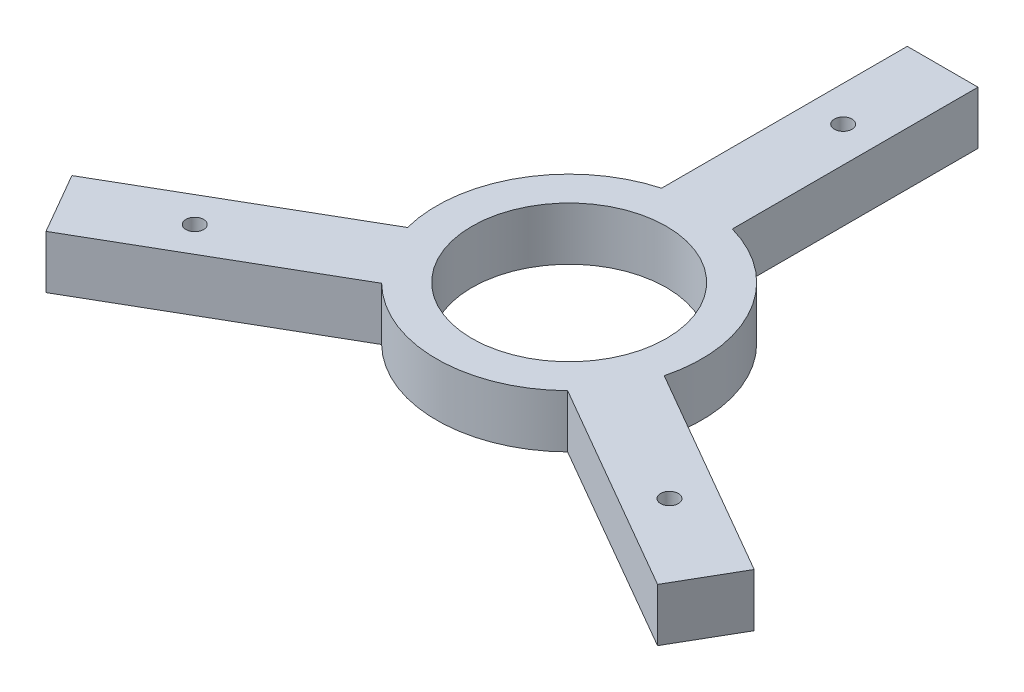
ISO-10303-21;
HEADER;
FILE_DESCRIPTION(('STEP AP214'),'2;1');
FILE_NAME('part.step','',(''),(''),'','','');
FILE_SCHEMA(('AUTOMOTIVE_DESIGN { 1 0 10303 214 1 1 1 1 }'));
ENDSEC;
DATA;
#1=APPLICATION_CONTEXT('core data for automotive mechanical design processes');
#2=APPLICATION_PROTOCOL_DEFINITION('international standard','automotive_design',2000,#1);
#3=PRODUCT_CONTEXT('',#1,'mechanical');
#4=PRODUCT('Part','Part','',(#3));
#5=PRODUCT_RELATED_PRODUCT_CATEGORY('part','',(#4));
#6=PRODUCT_DEFINITION_FORMATION('','',#4);
#7=PRODUCT_DEFINITION_CONTEXT('part definition',#1,'design');
#8=PRODUCT_DEFINITION('design','',#6,#7);
#9=PRODUCT_DEFINITION_SHAPE('','',#8);
#10=(LENGTH_UNIT() NAMED_UNIT(*) SI_UNIT(.MILLI.,.METRE.));
#11=(NAMED_UNIT(*) PLANE_ANGLE_UNIT() SI_UNIT($,.RADIAN.));
#12=(NAMED_UNIT(*) SI_UNIT($,.STERADIAN.) SOLID_ANGLE_UNIT());
#13=UNCERTAINTY_MEASURE_WITH_UNIT(LENGTH_MEASURE(1.E-05),#10,'distance_accuracy_value','');
#14=(GEOMETRIC_REPRESENTATION_CONTEXT(3) GLOBAL_UNCERTAINTY_ASSIGNED_CONTEXT((#13)) GLOBAL_UNIT_ASSIGNED_CONTEXT((#10,
#11,#12)) REPRESENTATION_CONTEXT('',''));
#15=CARTESIAN_POINT('',(0.,0.,0.));
#16=DIRECTION('',(0.,0.,1.));
#17=DIRECTION('',(1.,0.,0.));
#18=AXIS2_PLACEMENT_3D('',#15,#16,#17);
#19=CARTESIAN_POINT('',(0.,3.,0.));
#20=DIRECTION('',(0.,1.,0.));
#21=DIRECTION('',(0.,0.,1.));
#22=AXIS2_PLACEMENT_3D('',#19,#20,#21);
#23=PLANE('',#22);
#24=CARTESIAN_POINT('',(13.4233937586588,3.,7.75000000000006));
#25=DIRECTION('',(0.,1.,0.));
#26=DIRECTION('',(0.,0.,1.));
#27=AXIS2_PLACEMENT_3D('',#24,#25,#26);
#28=CIRCLE('',#27,0.499999999999999);
#29=CARTESIAN_POINT('',(13.4233937586588,3.,8.25000000000006));
#30=VERTEX_POINT('',#29);
#31=EDGE_CURVE('E446',#30,#30,#28,.T.);
#32=ORIENTED_EDGE('',*,*,#31,.F.);
#33=EDGE_LOOP('',(#32));
#34=FACE_BOUND('',#33,.T.);
#35=CARTESIAN_POINT('',(0.,3.,0.));
#36=DIRECTION('',(0.,1.,0.));
#37=DIRECTION('',(0.,0.,1.));
#38=AXIS2_PLACEMENT_3D('',#35,#36,#37);
#39=CIRCLE('',#38,5.5);
#40=CARTESIAN_POINT('',(0.,3.,5.5));
#41=VERTEX_POINT('',#40);
#42=EDGE_CURVE('E313',#41,#41,#39,.T.);
#43=ORIENTED_EDGE('',*,*,#42,.F.);
#44=EDGE_LOOP('',(#43));
#45=FACE_BOUND('',#44,.T.);
#46=CARTESIAN_POINT('',(0.,3.,0.));
#47=DIRECTION('',(0.,1.,0.));
#48=DIRECTION('',(0.,0.,1.));
#49=AXIS2_PLACEMENT_3D('',#46,#47,#48);
#50=CIRCLE('',#49,7.5);
#51=CARTESIAN_POINT('',(-2.,3.,-7.22841614740048));
#52=VERTEX_POINT('',#51);
#53=CARTESIAN_POINT('',(-7.25999201277445,3.,1.8821572661314));
#54=VERTEX_POINT('',#53);
#55=EDGE_CURVE('E332',#52,#54,#50,.T.);
#56=ORIENTED_EDGE('',*,*,#55,.T.);
#57=DIRECTION('',(-0.866025403784436,0.,0.500000000000004));
#58=VECTOR('',#57,1.);
#59=CARTESIAN_POINT('',(-7.25999201277445,3.,1.8821572661314));
#60=LINE('',#59,#58);
#61=CARTESIAN_POINT('',(-19.2934662978758,3.,8.82968688392118));
#62=VERTEX_POINT('',#61);
#63=EDGE_CURVE('E260',#54,#62,#60,.T.);
#64=ORIENTED_EDGE('',*,*,#63,.T.);
#65=DIRECTION('',(0.500000000000005,0.,0.866025403784436));
#66=VECTOR('',#65,1.);
#67=CARTESIAN_POINT('',(-19.2934662978758,3.,8.82968688392118));
#68=LINE('',#67,#66);
#69=CARTESIAN_POINT('',(-17.2934662978758,3.,12.2937884990589));
#70=VERTEX_POINT('',#69);
#71=EDGE_CURVE('E359',#62,#70,#68,.T.);
#72=ORIENTED_EDGE('',*,*,#71,.T.);
#73=DIRECTION('',(0.866025403784436,0.,-0.500000000000004));
#74=VECTOR('',#73,1.);
#75=CARTESIAN_POINT('',(-17.2934662978758,3.,12.2937884990589));
#76=LINE('',#75,#74);
#77=CARTESIAN_POINT('',(-5.25999201277443,3.,5.34625888126914));
#78=VERTEX_POINT('',#77);
#79=EDGE_CURVE('E378',#70,#78,#76,.T.);
#80=ORIENTED_EDGE('',*,*,#79,.T.);
#81=CARTESIAN_POINT('',(0.,3.,0.));
#82=DIRECTION('',(0.,1.,0.));
#83=DIRECTION('',(0.,0.,1.));
#84=AXIS2_PLACEMENT_3D('',#81,#82,#83);
#85=CIRCLE('',#84,7.5);
#86=CARTESIAN_POINT('',(5.25999201277443,3.,5.34625888126914));
#87=VERTEX_POINT('',#86);
#88=EDGE_CURVE('E375',#78,#87,#85,.T.);
#89=ORIENTED_EDGE('',*,*,#88,.T.);
#90=DIRECTION('',(0.866025403784436,0.,0.500000000000004));
#91=VECTOR('',#90,1.);
#92=CARTESIAN_POINT('',(5.25999201277443,3.,5.34625888126914));
#93=LINE('',#92,#91);
#94=CARTESIAN_POINT('',(17.2934662978757,3.,12.2937884990589));
#95=VERTEX_POINT('',#94);
#96=EDGE_CURVE('E377',#87,#95,#93,.T.);
#97=ORIENTED_EDGE('',*,*,#96,.T.);
#98=DIRECTION('',(0.500000000000004,0.,-0.866025403784437));
#99=VECTOR('',#98,1.);
#100=CARTESIAN_POINT('',(17.2934662978757,3.,12.2937884990589));
#101=LINE('',#100,#99);
#102=CARTESIAN_POINT('',(19.2934662978757,3.,8.8296868839211));
#103=VERTEX_POINT('',#102);
#104=EDGE_CURVE('E380',#95,#103,#101,.T.);
#105=ORIENTED_EDGE('',*,*,#104,.T.);
#106=DIRECTION('',(-0.866025403784437,0.,-0.500000000000004));
#107=VECTOR('',#106,1.);
#108=CARTESIAN_POINT('',(19.2934662978757,3.,8.8296868839211));
#109=LINE('',#108,#107);
#110=CARTESIAN_POINT('',(7.25999201277445,3.,1.88215726613139));
#111=VERTEX_POINT('',#110);
#112=EDGE_CURVE('E386',#103,#111,#109,.T.);
#113=ORIENTED_EDGE('',*,*,#112,.T.);
#114=CARTESIAN_POINT('',(0.,3.,0.));
#115=DIRECTION('',(0.,1.,0.));
#116=DIRECTION('',(0.,0.,1.));
#117=AXIS2_PLACEMENT_3D('',#114,#115,#116);
#118=CIRCLE('',#117,7.5);
#119=CARTESIAN_POINT('',(2.,3.,-7.22841614740048));
#120=VERTEX_POINT('',#119);
#121=EDGE_CURVE('E291',#111,#120,#118,.T.);
#122=ORIENTED_EDGE('',*,*,#121,.T.);
#123=DIRECTION('',(0.,0.,-1.));
#124=VECTOR('',#123,1.);
#125=CARTESIAN_POINT('',(2.,3.,-7.22841614740048));
#126=LINE('',#125,#124);
#127=CARTESIAN_POINT('',(1.99999999999999,3.,-21.1234753829798));
#128=VERTEX_POINT('',#127);
#129=EDGE_CURVE('E285',#120,#128,#126,.T.);
#130=ORIENTED_EDGE('',*,*,#129,.T.);
#131=DIRECTION('',(-1.,0.,0.));
#132=VECTOR('',#131,1.);
#133=CARTESIAN_POINT('',(1.99999999999999,3.,-21.1234753829798));
#134=LINE('',#133,#132);
#135=CARTESIAN_POINT('',(-2.00000000000001,3.,-21.1234753829798));
#136=VERTEX_POINT('',#135);
#137=EDGE_CURVE('E289',#128,#136,#134,.T.);
#138=ORIENTED_EDGE('',*,*,#137,.T.);
#139=DIRECTION('',(0.,0.,1.));
#140=VECTOR('',#139,1.);
#141=CARTESIAN_POINT('',(-2.00000000000001,3.,-21.1234753829798));
#142=LINE('',#141,#140);
#143=EDGE_CURVE('E205',#136,#52,#142,.T.);
#144=ORIENTED_EDGE('',*,*,#143,.T.);
#145=EDGE_LOOP('',(#56,#64,#72,#80,#89,#97,#105,#113,#122,#130,#138,#144));
#146=FACE_BOUND('',#145,.T.);
#147=CARTESIAN_POINT('',(-13.4233937586588,3.,7.75000000000006));
#148=DIRECTION('',(0.,1.,0.));
#149=DIRECTION('',(0.,0.,1.));
#150=AXIS2_PLACEMENT_3D('',#147,#148,#149);
#151=CIRCLE('',#150,0.499999999999999);
#152=CARTESIAN_POINT('',(-13.4233937586588,3.,8.25000000000006));
#153=VERTEX_POINT('',#152);
#154=EDGE_CURVE('E452',#153,#153,#151,.T.);
#155=ORIENTED_EDGE('',*,*,#154,.F.);
#156=EDGE_LOOP('',(#155));
#157=FACE_BOUND('',#156,.T.);
#158=CARTESIAN_POINT('',(0.,3.,-15.5));
#159=DIRECTION('',(0.,1.,0.));
#160=DIRECTION('',(0.,0.,1.));
#161=AXIS2_PLACEMENT_3D('',#158,#159,#160);
#162=CIRCLE('',#161,0.500000000000001);
#163=CARTESIAN_POINT('',(0.,3.,-15.));
#164=VERTEX_POINT('',#163);
#165=EDGE_CURVE('E437',#164,#164,#162,.T.);
#166=ORIENTED_EDGE('',*,*,#165,.F.);
#167=EDGE_LOOP('',(#166));
#168=FACE_BOUND('',#167,.T.);
#169=ADVANCED_FACE('F188',(#34,#45,#146,#157,#168),#23,.T.);
#170=CARTESIAN_POINT('',(0.,0.,0.));
#171=DIRECTION('',(0.,1.,0.));
#172=DIRECTION('',(0.,0.,1.));
#173=AXIS2_PLACEMENT_3D('',#170,#171,#172);
#174=PLANE('',#173);
#175=CARTESIAN_POINT('',(0.,0.,0.));
#176=DIRECTION('',(0.,1.,0.));
#177=DIRECTION('',(0.,0.,1.));
#178=AXIS2_PLACEMENT_3D('',#175,#176,#177);
#179=CIRCLE('',#178,7.5);
#180=CARTESIAN_POINT('',(-2.,0.,-7.22841614740048));
#181=VERTEX_POINT('',#180);
#182=CARTESIAN_POINT('',(-7.25999201277445,0.,1.8821572661314));
#183=VERTEX_POINT('',#182);
#184=EDGE_CURVE('E309',#181,#183,#179,.T.);
#185=ORIENTED_EDGE('',*,*,#184,.F.);
#186=DIRECTION('',(0.,0.,1.));
#187=VECTOR('',#186,1.);
#188=CARTESIAN_POINT('',(-2.00000000000001,0.,-21.1234753829798));
#189=LINE('',#188,#187);
#190=CARTESIAN_POINT('',(-2.00000000000001,0.,-21.1234753829798));
#191=VERTEX_POINT('',#190);
#192=EDGE_CURVE('E252',#191,#181,#189,.T.);
#193=ORIENTED_EDGE('',*,*,#192,.F.);
#194=DIRECTION('',(-1.,0.,0.));
#195=VECTOR('',#194,1.);
#196=CARTESIAN_POINT('',(1.99999999999999,0.,-21.1234753829798));
#197=LINE('',#196,#195);
#198=CARTESIAN_POINT('',(1.99999999999999,0.,-21.1234753829798));
#199=VERTEX_POINT('',#198);
#200=EDGE_CURVE('E246',#199,#191,#197,.T.);
#201=ORIENTED_EDGE('',*,*,#200,.F.);
#202=DIRECTION('',(0.,0.,-1.));
#203=VECTOR('',#202,1.);
#204=CARTESIAN_POINT('',(2.,0.,-7.22841614740048));
#205=LINE('',#204,#203);
#206=CARTESIAN_POINT('',(2.,0.,-7.22841614740048));
#207=VERTEX_POINT('',#206);
#208=EDGE_CURVE('E299',#207,#199,#205,.T.);
#209=ORIENTED_EDGE('',*,*,#208,.F.);
#210=CARTESIAN_POINT('',(0.,0.,0.));
#211=DIRECTION('',(0.,1.,0.));
#212=DIRECTION('',(0.,0.,1.));
#213=AXIS2_PLACEMENT_3D('',#210,#211,#212);
#214=CIRCLE('',#213,7.5);
#215=CARTESIAN_POINT('',(7.25999201277445,0.,1.88215726613139));
#216=VERTEX_POINT('',#215);
#217=EDGE_CURVE('E327',#216,#207,#214,.T.);
#218=ORIENTED_EDGE('',*,*,#217,.F.);
#219=DIRECTION('',(-0.866025403784437,0.,-0.500000000000004));
#220=VECTOR('',#219,1.);
#221=CARTESIAN_POINT('',(19.2934662978757,0.,8.8296868839211));
#222=LINE('',#221,#220);
#223=CARTESIAN_POINT('',(19.2934662978757,0.,8.8296868839211));
#224=VERTEX_POINT('',#223);
#225=EDGE_CURVE('E325',#224,#216,#222,.T.);
#226=ORIENTED_EDGE('',*,*,#225,.F.);
#227=DIRECTION('',(0.500000000000004,0.,-0.866025403784437));
#228=VECTOR('',#227,1.);
#229=CARTESIAN_POINT('',(17.2934662978757,0.,12.2937884990589));
#230=LINE('',#229,#228);
#231=CARTESIAN_POINT('',(17.2934662978757,0.,12.2937884990589));
#232=VERTEX_POINT('',#231);
#233=EDGE_CURVE('E323',#232,#224,#230,.T.);
#234=ORIENTED_EDGE('',*,*,#233,.F.);
#235=DIRECTION('',(0.866025403784436,0.,0.500000000000004));
#236=VECTOR('',#235,1.);
#237=CARTESIAN_POINT('',(5.25999201277443,0.,5.34625888126914));
#238=LINE('',#237,#236);
#239=CARTESIAN_POINT('',(5.25999201277443,0.,5.34625888126914));
#240=VERTEX_POINT('',#239);
#241=EDGE_CURVE('E321',#240,#232,#238,.T.);
#242=ORIENTED_EDGE('',*,*,#241,.F.);
#243=CARTESIAN_POINT('',(0.,0.,0.));
#244=DIRECTION('',(0.,1.,0.));
#245=DIRECTION('',(0.,0.,1.));
#246=AXIS2_PLACEMENT_3D('',#243,#244,#245);
#247=CIRCLE('',#246,7.5);
#248=CARTESIAN_POINT('',(-5.25999201277443,0.,5.34625888126914));
#249=VERTEX_POINT('',#248);
#250=EDGE_CURVE('E319',#249,#240,#247,.T.);
#251=ORIENTED_EDGE('',*,*,#250,.F.);
#252=DIRECTION('',(0.866025403784436,0.,-0.500000000000004));
#253=VECTOR('',#252,1.);
#254=CARTESIAN_POINT('',(-17.2934662978758,0.,12.2937884990589));
#255=LINE('',#254,#253);
#256=CARTESIAN_POINT('',(-17.2934662978758,0.,12.2937884990589));
#257=VERTEX_POINT('',#256);
#258=EDGE_CURVE('E317',#257,#249,#255,.T.);
#259=ORIENTED_EDGE('',*,*,#258,.F.);
#260=DIRECTION('',(0.500000000000005,0.,0.866025403784436));
#261=VECTOR('',#260,1.);
#262=CARTESIAN_POINT('',(-19.2934662978758,0.,8.82968688392118));
#263=LINE('',#262,#261);
#264=CARTESIAN_POINT('',(-19.2934662978758,0.,8.82968688392118));
#265=VERTEX_POINT('',#264);
#266=EDGE_CURVE('E315',#265,#257,#263,.T.);
#267=ORIENTED_EDGE('',*,*,#266,.F.);
#268=DIRECTION('',(-0.866025403784436,0.,0.500000000000004));
#269=VECTOR('',#268,1.);
#270=CARTESIAN_POINT('',(-7.25999201277445,0.,1.8821572661314));
#271=LINE('',#270,#269);
#272=EDGE_CURVE('E312',#183,#265,#271,.T.);
#273=ORIENTED_EDGE('',*,*,#272,.F.);
#274=EDGE_LOOP('',(#185,#193,#201,#209,#218,#226,#234,#242,#251,#259,#267,#273));
#275=FACE_BOUND('',#274,.T.);
#276=CARTESIAN_POINT('',(0.,0.,0.));
#277=DIRECTION('',(0.,1.,0.));
#278=DIRECTION('',(0.,0.,1.));
#279=AXIS2_PLACEMENT_3D('',#276,#277,#278);
#280=CIRCLE('',#279,5.5);
#281=CARTESIAN_POINT('',(0.,0.,5.5));
#282=VERTEX_POINT('',#281);
#283=EDGE_CURVE('E455',#282,#282,#280,.T.);
#284=ORIENTED_EDGE('',*,*,#283,.T.);
#285=EDGE_LOOP('',(#284));
#286=FACE_BOUND('',#285,.T.);
#287=CARTESIAN_POINT('',(-13.4233937586588,0.,7.75000000000006));
#288=DIRECTION('',(0.,1.,0.));
#289=DIRECTION('',(0.,0.,1.));
#290=AXIS2_PLACEMENT_3D('',#287,#288,#289);
#291=CIRCLE('',#290,0.499999999999999);
#292=CARTESIAN_POINT('',(-13.4233937586588,0.,8.25000000000006));
#293=VERTEX_POINT('',#292);
#294=EDGE_CURVE('E449',#293,#293,#291,.T.);
#295=ORIENTED_EDGE('',*,*,#294,.T.);
#296=EDGE_LOOP('',(#295));
#297=FACE_BOUND('',#296,.T.);
#298=CARTESIAN_POINT('',(13.4233937586588,0.,7.75000000000006));
#299=DIRECTION('',(0.,1.,0.));
#300=DIRECTION('',(0.,0.,1.));
#301=AXIS2_PLACEMENT_3D('',#298,#299,#300);
#302=CIRCLE('',#301,0.499999999999999);
#303=CARTESIAN_POINT('',(13.4233937586588,0.,8.25000000000006));
#304=VERTEX_POINT('',#303);
#305=EDGE_CURVE('E443',#304,#304,#302,.T.);
#306=ORIENTED_EDGE('',*,*,#305,.T.);
#307=EDGE_LOOP('',(#306));
#308=FACE_BOUND('',#307,.T.);
#309=CARTESIAN_POINT('',(0.,0.,-15.5));
#310=DIRECTION('',(0.,1.,0.));
#311=DIRECTION('',(0.,0.,1.));
#312=AXIS2_PLACEMENT_3D('',#309,#310,#311);
#313=CIRCLE('',#312,0.500000000000001);
#314=CARTESIAN_POINT('',(0.,0.,-15.));
#315=VERTEX_POINT('',#314);
#316=EDGE_CURVE('E440',#315,#315,#313,.T.);
#317=ORIENTED_EDGE('',*,*,#316,.T.);
#318=EDGE_LOOP('',(#317));
#319=FACE_BOUND('',#318,.T.);
#320=ADVANCED_FACE('F363',(#275,#286,#297,#308,#319),#174,.F.);
#321=CARTESIAN_POINT('',(0.,3.,0.));
#322=DIRECTION('',(0.,-1.,0.));
#323=DIRECTION('',(0.,0.,-1.));
#324=AXIS2_PLACEMENT_3D('',#321,#322,#323);
#325=CYLINDRICAL_SURFACE('',#324,7.5);
#326=ORIENTED_EDGE('',*,*,#184,.T.);
#327=DIRECTION('',(0.,-1.,0.));
#328=VECTOR('',#327,1.);
#329=CARTESIAN_POINT('',(-7.25999201277445,3.,1.8821572661314));
#330=LINE('',#329,#328);
#331=EDGE_CURVE('E12',#54,#183,#330,.T.);
#332=ORIENTED_EDGE('',*,*,#331,.F.);
#333=ORIENTED_EDGE('',*,*,#55,.F.);
#334=DIRECTION('',(0.,-1.,0.));
#335=VECTOR('',#334,1.);
#336=CARTESIAN_POINT('',(-2.,3.,-7.22841614740048));
#337=LINE('',#336,#335);
#338=EDGE_CURVE('E305',#52,#181,#337,.T.);
#339=ORIENTED_EDGE('',*,*,#338,.T.);
#340=EDGE_LOOP('',(#326,#332,#333,#339));
#341=FACE_BOUND('',#340,.T.);
#342=ADVANCED_FACE('F190',(#341),#325,.T.);
#343=CARTESIAN_POINT('',(-7.25999201277445,3.,1.8821572661314));
#344=DIRECTION('',(0.500000000000004,0.,0.866025403784436));
#345=DIRECTION('',(0.866025403784436,0.,-0.500000000000004));
#346=AXIS2_PLACEMENT_3D('',#343,#344,#345);
#347=PLANE('',#346);
#348=ORIENTED_EDGE('',*,*,#272,.T.);
#349=DIRECTION('',(0.,-1.,0.));
#350=VECTOR('',#349,1.);
#351=CARTESIAN_POINT('',(-19.2934662978758,3.,8.82968688392118));
#352=LINE('',#351,#350);
#353=EDGE_CURVE('E197',#62,#265,#352,.T.);
#354=ORIENTED_EDGE('',*,*,#353,.F.);
#355=ORIENTED_EDGE('',*,*,#63,.F.);
#356=ORIENTED_EDGE('',*,*,#331,.T.);
#357=EDGE_LOOP('',(#348,#354,#355,#356));
#358=FACE_BOUND('',#357,.T.);
#359=ADVANCED_FACE('F565',(#358),#347,.F.);
#360=CARTESIAN_POINT('',(-19.2934662978758,3.,8.82968688392118));
#361=DIRECTION('',(0.866025403784436,0.,-0.500000000000005));
#362=DIRECTION('',(-0.500000000000005,0.,-0.866025403784436));
#363=AXIS2_PLACEMENT_3D('',#360,#361,#362);
#364=PLANE('',#363);
#365=ORIENTED_EDGE('',*,*,#266,.T.);
#366=DIRECTION('',(0.,-1.,0.));
#367=VECTOR('',#366,1.);
#368=CARTESIAN_POINT('',(-17.2934662978758,3.,12.2937884990589));
#369=LINE('',#368,#367);
#370=EDGE_CURVE('E351',#70,#257,#369,.T.);
#371=ORIENTED_EDGE('',*,*,#370,.F.);
#372=ORIENTED_EDGE('',*,*,#71,.F.);
#373=ORIENTED_EDGE('',*,*,#353,.T.);
#374=EDGE_LOOP('',(#365,#371,#372,#373));
#375=FACE_BOUND('',#374,.T.);
#376=ADVANCED_FACE('F357',(#375),#364,.F.);
#377=CARTESIAN_POINT('',(-17.2934662978758,3.,12.2937884990589));
#378=DIRECTION('',(-0.500000000000004,0.,-0.866025403784436));
#379=DIRECTION('',(-0.866025403784436,0.,0.500000000000004));
#380=AXIS2_PLACEMENT_3D('',#377,#378,#379);
#381=PLANE('',#380);
#382=ORIENTED_EDGE('',*,*,#258,.T.);
#383=DIRECTION('',(0.,-1.,0.));
#384=VECTOR('',#383,1.);
#385=CARTESIAN_POINT('',(-5.25999201277443,3.,5.34625888126914));
#386=LINE('',#385,#384);
#387=EDGE_CURVE('E348',#78,#249,#386,.T.);
#388=ORIENTED_EDGE('',*,*,#387,.F.);
#389=ORIENTED_EDGE('',*,*,#79,.F.);
#390=ORIENTED_EDGE('',*,*,#370,.T.);
#391=EDGE_LOOP('',(#382,#388,#389,#390));
#392=FACE_BOUND('',#391,.T.);
#393=ADVANCED_FACE('F369',(#392),#381,.F.);
#394=CARTESIAN_POINT('',(0.,3.,0.));
#395=DIRECTION('',(0.,-1.,0.));
#396=DIRECTION('',(0.,0.,-1.));
#397=AXIS2_PLACEMENT_3D('',#394,#395,#396);
#398=CYLINDRICAL_SURFACE('',#397,7.5);
#399=ORIENTED_EDGE('',*,*,#250,.T.);
#400=DIRECTION('',(0.,-1.,0.));
#401=VECTOR('',#400,1.);
#402=CARTESIAN_POINT('',(5.25999201277443,3.,5.34625888126914));
#403=LINE('',#402,#401);
#404=EDGE_CURVE('E345',#87,#240,#403,.T.);
#405=ORIENTED_EDGE('',*,*,#404,.F.);
#406=ORIENTED_EDGE('',*,*,#88,.F.);
#407=ORIENTED_EDGE('',*,*,#387,.T.);
#408=EDGE_LOOP('',(#399,#405,#406,#407));
#409=FACE_BOUND('',#408,.T.);
#410=ADVANCED_FACE('F373',(#409),#398,.T.);
#411=CARTESIAN_POINT('',(5.25999201277443,3.,5.34625888126914));
#412=DIRECTION('',(0.500000000000004,0.,-0.866025403784437));
#413=DIRECTION('',(-0.866025403784437,0.,-0.500000000000004));
#414=AXIS2_PLACEMENT_3D('',#411,#412,#413);
#415=PLANE('',#414);
#416=ORIENTED_EDGE('',*,*,#241,.T.);
#417=DIRECTION('',(0.,-1.,0.));
#418=VECTOR('',#417,1.);
#419=CARTESIAN_POINT('',(17.2934662978757,3.,12.2937884990589));
#420=LINE('',#419,#418);
#421=EDGE_CURVE('E342',#95,#232,#420,.T.);
#422=ORIENTED_EDGE('',*,*,#421,.F.);
#423=ORIENTED_EDGE('',*,*,#96,.F.);
#424=ORIENTED_EDGE('',*,*,#404,.T.);
#425=EDGE_LOOP('',(#416,#422,#423,#424));
#426=FACE_BOUND('',#425,.T.);
#427=ADVANCED_FACE('F530',(#426),#415,.F.);
#428=CARTESIAN_POINT('',(17.2934662978757,3.,12.2937884990589));
#429=DIRECTION('',(-0.866025403784436,0.,-0.500000000000004));
#430=DIRECTION('',(-0.500000000000004,0.,0.866025403784437));
#431=AXIS2_PLACEMENT_3D('',#428,#429,#430);
#432=PLANE('',#431);
#433=ORIENTED_EDGE('',*,*,#233,.T.);
#434=DIRECTION('',(0.,-1.,0.));
#435=VECTOR('',#434,1.);
#436=CARTESIAN_POINT('',(19.2934662978757,3.,8.8296868839211));
#437=LINE('',#436,#435);
#438=EDGE_CURVE('E339',#103,#224,#437,.T.);
#439=ORIENTED_EDGE('',*,*,#438,.F.);
#440=ORIENTED_EDGE('',*,*,#104,.F.);
#441=ORIENTED_EDGE('',*,*,#421,.T.);
#442=EDGE_LOOP('',(#433,#439,#440,#441));
#443=FACE_BOUND('',#442,.T.);
#444=ADVANCED_FACE('F521',(#443),#432,.F.);
#445=CARTESIAN_POINT('',(19.2934662978757,3.,8.8296868839211));
#446=DIRECTION('',(-0.500000000000003,0.,0.866025403784437));
#447=DIRECTION('',(0.866025403784437,0.,0.500000000000004));
#448=AXIS2_PLACEMENT_3D('',#445,#446,#447);
#449=PLANE('',#448);
#450=ORIENTED_EDGE('',*,*,#225,.T.);
#451=DIRECTION('',(0.,-1.,0.));
#452=VECTOR('',#451,1.);
#453=CARTESIAN_POINT('',(7.25999201277445,3.,1.88215726613139));
#454=LINE('',#453,#452);
#455=EDGE_CURVE('E336',#111,#216,#454,.T.);
#456=ORIENTED_EDGE('',*,*,#455,.F.);
#457=ORIENTED_EDGE('',*,*,#112,.F.);
#458=ORIENTED_EDGE('',*,*,#438,.T.);
#459=EDGE_LOOP('',(#450,#456,#457,#458));
#460=FACE_BOUND('',#459,.T.);
#461=ADVANCED_FACE('F392',(#460),#449,.F.);
#462=CARTESIAN_POINT('',(0.,3.,0.));
#463=DIRECTION('',(0.,-1.,0.));
#464=DIRECTION('',(0.,0.,-1.));
#465=AXIS2_PLACEMENT_3D('',#462,#463,#464);
#466=CYLINDRICAL_SURFACE('',#465,7.5);
#467=ORIENTED_EDGE('',*,*,#217,.T.);
#468=DIRECTION('',(0.,-1.,0.));
#469=VECTOR('',#468,1.);
#470=CARTESIAN_POINT('',(2.,3.,-7.22841614740048));
#471=LINE('',#470,#469);
#472=EDGE_CURVE('E300',#120,#207,#471,.T.);
#473=ORIENTED_EDGE('',*,*,#472,.F.);
#474=ORIENTED_EDGE('',*,*,#121,.F.);
#475=ORIENTED_EDGE('',*,*,#455,.T.);
#476=EDGE_LOOP('',(#467,#473,#474,#475));
#477=FACE_BOUND('',#476,.T.);
#478=ADVANCED_FACE('F396',(#477),#466,.T.);
#479=CARTESIAN_POINT('',(2.,3.,-7.22841614740048));
#480=DIRECTION('',(-1.,0.,0.));
#481=DIRECTION('',(0.,0.,1.));
#482=AXIS2_PLACEMENT_3D('',#479,#480,#481);
#483=PLANE('',#482);
#484=ORIENTED_EDGE('',*,*,#208,.T.);
#485=DIRECTION('',(0.,-1.,0.));
#486=VECTOR('',#485,1.);
#487=CARTESIAN_POINT('',(1.99999999999999,3.,-21.1234753829798));
#488=LINE('',#487,#486);
#489=EDGE_CURVE('E296',#128,#199,#488,.T.);
#490=ORIENTED_EDGE('',*,*,#489,.F.);
#491=ORIENTED_EDGE('',*,*,#129,.F.);
#492=ORIENTED_EDGE('',*,*,#472,.T.);
#493=EDGE_LOOP('',(#484,#490,#491,#492));
#494=FACE_BOUND('',#493,.T.);
#495=ADVANCED_FACE('F297',(#494),#483,.F.);
#496=CARTESIAN_POINT('',(1.99999999999999,3.,-21.1234753829798));
#497=DIRECTION('',(0.,0.,1.));
#498=DIRECTION('',(1.,0.,0.));
#499=AXIS2_PLACEMENT_3D('',#496,#497,#498);
#500=PLANE('',#499);
#501=ORIENTED_EDGE('',*,*,#200,.T.);
#502=DIRECTION('',(0.,-1.,0.));
#503=VECTOR('',#502,1.);
#504=CARTESIAN_POINT('',(-2.00000000000001,3.,-21.1234753829798));
#505=LINE('',#504,#503);
#506=EDGE_CURVE('E301',#136,#191,#505,.T.);
#507=ORIENTED_EDGE('',*,*,#506,.F.);
#508=ORIENTED_EDGE('',*,*,#137,.F.);
#509=ORIENTED_EDGE('',*,*,#489,.T.);
#510=EDGE_LOOP('',(#501,#507,#508,#509));
#511=FACE_BOUND('',#510,.T.);
#512=ADVANCED_FACE('F303',(#511),#500,.F.);
#513=CARTESIAN_POINT('',(-2.00000000000001,3.,-21.1234753829798));
#514=DIRECTION('',(1.,0.,0.));
#515=DIRECTION('',(0.,0.,-1.));
#516=AXIS2_PLACEMENT_3D('',#513,#514,#515);
#517=PLANE('',#516);
#518=ORIENTED_EDGE('',*,*,#192,.T.);
#519=ORIENTED_EDGE('',*,*,#338,.F.);
#520=ORIENTED_EDGE('',*,*,#143,.F.);
#521=ORIENTED_EDGE('',*,*,#506,.T.);
#522=EDGE_LOOP('',(#518,#519,#520,#521));
#523=FACE_BOUND('',#522,.T.);
#524=ADVANCED_FACE('F400',(#523),#517,.F.);
#525=CARTESIAN_POINT('',(0.,3.,0.));
#526=DIRECTION('',(0.,-1.,0.));
#527=DIRECTION('',(0.,0.,-1.));
#528=AXIS2_PLACEMENT_3D('',#525,#526,#527);
#529=CYLINDRICAL_SURFACE('',#528,5.5);
#530=ORIENTED_EDGE('',*,*,#42,.T.);
#531=EDGE_LOOP('',(#530));
#532=FACE_BOUND('',#531,.T.);
#533=ORIENTED_EDGE('',*,*,#283,.F.);
#534=EDGE_LOOP('',(#533));
#535=FACE_BOUND('',#534,.T.);
#536=ADVANCED_FACE('F402',(#532,#535),#529,.F.);
#537=CARTESIAN_POINT('',(-13.4233937586588,3.,7.75000000000006));
#538=DIRECTION('',(0.,-1.,0.));
#539=DIRECTION('',(0.,0.,-1.));
#540=AXIS2_PLACEMENT_3D('',#537,#538,#539);
#541=CYLINDRICAL_SURFACE('',#540,0.499999999999999);
#542=ORIENTED_EDGE('',*,*,#154,.T.);
#543=EDGE_LOOP('',(#542));
#544=FACE_BOUND('',#543,.T.);
#545=ORIENTED_EDGE('',*,*,#294,.F.);
#546=EDGE_LOOP('',(#545));
#547=FACE_BOUND('',#546,.T.);
#548=ADVANCED_FACE('F408',(#544,#547),#541,.F.);
#549=CARTESIAN_POINT('',(13.4233937586588,3.,7.75000000000006));
#550=DIRECTION('',(0.,-1.,0.));
#551=DIRECTION('',(0.,0.,-1.));
#552=AXIS2_PLACEMENT_3D('',#549,#550,#551);
#553=CYLINDRICAL_SURFACE('',#552,0.499999999999999);
#554=ORIENTED_EDGE('',*,*,#31,.T.);
#555=EDGE_LOOP('',(#554));
#556=FACE_BOUND('',#555,.T.);
#557=ORIENTED_EDGE('',*,*,#305,.F.);
#558=EDGE_LOOP('',(#557));
#559=FACE_BOUND('',#558,.T.);
#560=ADVANCED_FACE('F424',(#556,#559),#553,.F.);
#561=CARTESIAN_POINT('',(0.,3.,-15.5));
#562=DIRECTION('',(0.,-1.,0.));
#563=DIRECTION('',(0.,0.,-1.));
#564=AXIS2_PLACEMENT_3D('',#561,#562,#563);
#565=CYLINDRICAL_SURFACE('',#564,0.500000000000001);
#566=ORIENTED_EDGE('',*,*,#165,.T.);
#567=EDGE_LOOP('',(#566));
#568=FACE_BOUND('',#567,.T.);
#569=ORIENTED_EDGE('',*,*,#316,.F.);
#570=EDGE_LOOP('',(#569));
#571=FACE_BOUND('',#570,.T.);
#572=ADVANCED_FACE('F428',(#568,#571),#565,.F.);
#573=CLOSED_SHELL('',(#169,#320,#342,#359,#376,#393,#410,#427,#444,#461,#478,#495,#512,#524,
#536,#548,#560,#572));
#574=MANIFOLD_SOLID_BREP('B2',#573);
#575=ADVANCED_BREP_SHAPE_REPRESENTATION('',(#18,#574),#14);
#576=SHAPE_DEFINITION_REPRESENTATION(#9,#575);
ENDSEC;
END-ISO-10303-21;
